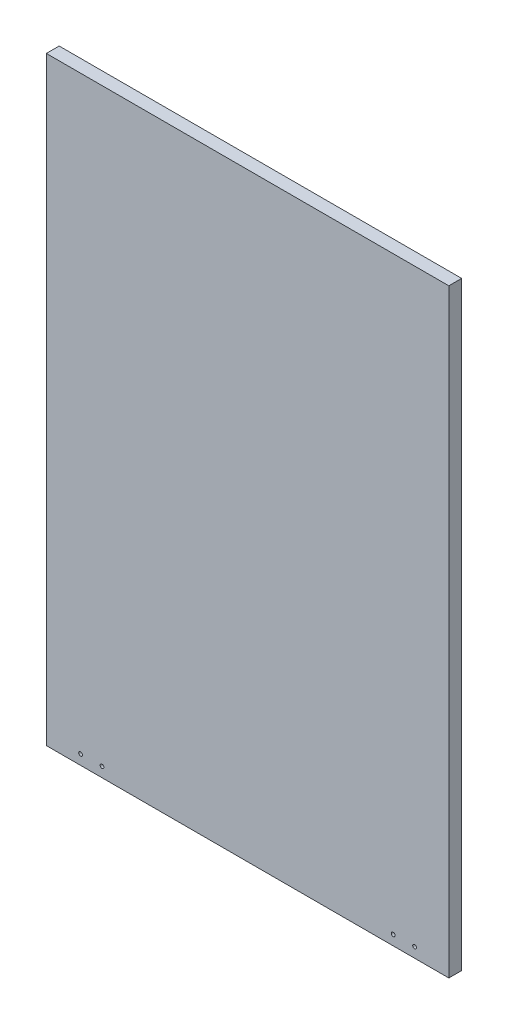
ISO-10303-21;
HEADER;
FILE_DESCRIPTION(('STEP AP214'),'2;1');
FILE_NAME('part.step','',(''),(''),'','','');
FILE_SCHEMA(('AUTOMOTIVE_DESIGN { 1 0 10303 214 1 1 1 1 }'));
ENDSEC;
DATA;
#1=APPLICATION_CONTEXT('core data for automotive mechanical design processes');
#2=APPLICATION_PROTOCOL_DEFINITION('international standard','automotive_design',2000,#1);
#3=PRODUCT_CONTEXT('',#1,'mechanical');
#4=PRODUCT('Part','Part','',(#3));
#5=PRODUCT_RELATED_PRODUCT_CATEGORY('part','',(#4));
#6=PRODUCT_DEFINITION_FORMATION('','',#4);
#7=PRODUCT_DEFINITION_CONTEXT('part definition',#1,'design');
#8=PRODUCT_DEFINITION('design','',#6,#7);
#9=PRODUCT_DEFINITION_SHAPE('','',#8);
#10=(LENGTH_UNIT() NAMED_UNIT(*) SI_UNIT(.MILLI.,.METRE.));
#11=(NAMED_UNIT(*) PLANE_ANGLE_UNIT() SI_UNIT($,.RADIAN.));
#12=(NAMED_UNIT(*) SI_UNIT($,.STERADIAN.) SOLID_ANGLE_UNIT());
#13=UNCERTAINTY_MEASURE_WITH_UNIT(LENGTH_MEASURE(1.E-05),#10,'distance_accuracy_value','');
#14=(GEOMETRIC_REPRESENTATION_CONTEXT(3) GLOBAL_UNCERTAINTY_ASSIGNED_CONTEXT((#13)) GLOBAL_UNIT_ASSIGNED_CONTEXT((#10,
#11,#12)) REPRESENTATION_CONTEXT('',''));
#15=CARTESIAN_POINT('',(0.,0.,0.));
#16=DIRECTION('',(0.,0.,1.));
#17=DIRECTION('',(1.,0.,0.));
#18=AXIS2_PLACEMENT_3D('',#15,#16,#17);
#19=CARTESIAN_POINT('',(0.,0.,15.));
#20=DIRECTION('',(0.,0.,1.));
#21=DIRECTION('',(1.,0.,0.));
#22=AXIS2_PLACEMENT_3D('',#19,#20,#21);
#23=PLANE('',#22);
#24=CARTESIAN_POINT('',(-170.,-338.4,15.));
#25=DIRECTION('',(0.,0.,1.));
#26=DIRECTION('',(1.,0.,0.));
#27=AXIS2_PLACEMENT_3D('',#24,#25,#26);
#28=CIRCLE('',#27,2.20000000000001);
#29=CARTESIAN_POINT('',(-167.8,-338.4,15.));
#30=VERTEX_POINT('',#29);
#31=EDGE_CURVE('E120',#30,#30,#28,.T.);
#32=ORIENTED_EDGE('',*,*,#31,.F.);
#33=EDGE_LOOP('',(#32));
#34=FACE_BOUND('',#33,.T.);
#35=CARTESIAN_POINT('',(-195.,-338.4,15.));
#36=DIRECTION('',(0.,0.,1.));
#37=DIRECTION('',(1.,0.,0.));
#38=AXIS2_PLACEMENT_3D('',#35,#36,#37);
#39=CIRCLE('',#38,2.20000000000001);
#40=CARTESIAN_POINT('',(-192.8,-338.4,15.));
#41=VERTEX_POINT('',#40);
#42=EDGE_CURVE('E99',#41,#41,#39,.T.);
#43=ORIENTED_EDGE('',*,*,#42,.F.);
#44=EDGE_LOOP('',(#43));
#45=FACE_BOUND('',#44,.T.);
#46=DIRECTION('',(0.,1.,0.));
#47=VECTOR('',#46,1.);
#48=CARTESIAN_POINT('',(235.,350.,15.));
#49=LINE('',#48,#47);
#50=CARTESIAN_POINT('',(235.,-350.,15.));
#51=VERTEX_POINT('',#50);
#52=CARTESIAN_POINT('',(235.,350.,15.));
#53=VERTEX_POINT('',#52);
#54=EDGE_CURVE('E84',#51,#53,#49,.T.);
#55=ORIENTED_EDGE('',*,*,#54,.T.);
#56=DIRECTION('',(-1.,0.,0.));
#57=VECTOR('',#56,1.);
#58=CARTESIAN_POINT('',(-235.,350.,15.));
#59=LINE('',#58,#57);
#60=CARTESIAN_POINT('',(-235.,350.,15.));
#61=VERTEX_POINT('',#60);
#62=EDGE_CURVE('E79',#53,#61,#59,.T.);
#63=ORIENTED_EDGE('',*,*,#62,.T.);
#64=DIRECTION('',(0.,-1.,0.));
#65=VECTOR('',#64,1.);
#66=CARTESIAN_POINT('',(-235.,350.,15.));
#67=LINE('',#66,#65);
#68=CARTESIAN_POINT('',(-235.,-350.,15.));
#69=VERTEX_POINT('',#68);
#70=EDGE_CURVE('E82',#61,#69,#67,.T.);
#71=ORIENTED_EDGE('',*,*,#70,.T.);
#72=DIRECTION('',(1.,0.,0.));
#73=VECTOR('',#72,1.);
#74=CARTESIAN_POINT('',(-235.,-350.,15.));
#75=LINE('',#74,#73);
#76=EDGE_CURVE('E49',#69,#51,#75,.T.);
#77=ORIENTED_EDGE('',*,*,#76,.T.);
#78=EDGE_LOOP('',(#55,#63,#71,#77));
#79=FACE_BOUND('',#78,.T.);
#80=CARTESIAN_POINT('',(195.,-338.4,15.));
#81=DIRECTION('',(0.,0.,1.));
#82=DIRECTION('',(1.,0.,0.));
#83=AXIS2_PLACEMENT_3D('',#80,#81,#82);
#84=CIRCLE('',#83,2.20000000000001);
#85=CARTESIAN_POINT('',(197.2,-338.4,15.));
#86=VERTEX_POINT('',#85);
#87=EDGE_CURVE('E114',#86,#86,#84,.T.);
#88=ORIENTED_EDGE('',*,*,#87,.F.);
#89=EDGE_LOOP('',(#88));
#90=FACE_BOUND('',#89,.T.);
#91=CARTESIAN_POINT('',(170.,-338.4,15.));
#92=DIRECTION('',(0.,0.,1.));
#93=DIRECTION('',(1.,0.,0.));
#94=AXIS2_PLACEMENT_3D('',#91,#92,#93);
#95=CIRCLE('',#94,2.20000000000001);
#96=CARTESIAN_POINT('',(172.2,-338.4,15.));
#97=VERTEX_POINT('',#96);
#98=EDGE_CURVE('E126',#97,#97,#95,.T.);
#99=ORIENTED_EDGE('',*,*,#98,.F.);
#100=EDGE_LOOP('',(#99));
#101=FACE_BOUND('',#100,.T.);
#102=ADVANCED_FACE('F32',(#34,#45,#79,#90,#101),#23,.T.);
#103=CARTESIAN_POINT('',(0.,0.,0.));
#104=DIRECTION('',(0.,0.,1.));
#105=DIRECTION('',(1.,0.,0.));
#106=AXIS2_PLACEMENT_3D('',#103,#104,#105);
#107=PLANE('',#106);
#108=CARTESIAN_POINT('',(-170.,-338.4,0.));
#109=DIRECTION('',(0.,0.,1.));
#110=DIRECTION('',(1.,0.,0.));
#111=AXIS2_PLACEMENT_3D('',#108,#109,#110);
#112=CIRCLE('',#111,2.20000000000001);
#113=CARTESIAN_POINT('',(-167.8,-338.4,0.));
#114=VERTEX_POINT('',#113);
#115=EDGE_CURVE('E123',#114,#114,#112,.T.);
#116=ORIENTED_EDGE('',*,*,#115,.T.);
#117=EDGE_LOOP('',(#116));
#118=FACE_BOUND('',#117,.T.);
#119=CARTESIAN_POINT('',(-195.,-338.4,0.));
#120=DIRECTION('',(0.,0.,1.));
#121=DIRECTION('',(1.,0.,0.));
#122=AXIS2_PLACEMENT_3D('',#119,#120,#121);
#123=CIRCLE('',#122,2.20000000000001);
#124=CARTESIAN_POINT('',(-192.8,-338.4,0.));
#125=VERTEX_POINT('',#124);
#126=EDGE_CURVE('E111',#125,#125,#123,.T.);
#127=ORIENTED_EDGE('',*,*,#126,.T.);
#128=EDGE_LOOP('',(#127));
#129=FACE_BOUND('',#128,.T.);
#130=DIRECTION('',(0.,1.,0.));
#131=VECTOR('',#130,1.);
#132=CARTESIAN_POINT('',(235.,350.,0.));
#133=LINE('',#132,#131);
#134=CARTESIAN_POINT('',(235.,-350.,0.));
#135=VERTEX_POINT('',#134);
#136=CARTESIAN_POINT('',(235.,350.,0.));
#137=VERTEX_POINT('',#136);
#138=EDGE_CURVE('E96',#135,#137,#133,.T.);
#139=ORIENTED_EDGE('',*,*,#138,.F.);
#140=DIRECTION('',(1.,0.,0.));
#141=VECTOR('',#140,1.);
#142=CARTESIAN_POINT('',(-235.,-350.,0.));
#143=LINE('',#142,#141);
#144=CARTESIAN_POINT('',(-235.,-350.,0.));
#145=VERTEX_POINT('',#144);
#146=EDGE_CURVE('E72',#145,#135,#143,.T.);
#147=ORIENTED_EDGE('',*,*,#146,.F.);
#148=DIRECTION('',(0.,-1.,0.));
#149=VECTOR('',#148,1.);
#150=CARTESIAN_POINT('',(-235.,350.,0.));
#151=LINE('',#150,#149);
#152=CARTESIAN_POINT('',(-235.,350.,0.));
#153=VERTEX_POINT('',#152);
#154=EDGE_CURVE('E66',#153,#145,#151,.T.);
#155=ORIENTED_EDGE('',*,*,#154,.F.);
#156=DIRECTION('',(-1.,0.,0.));
#157=VECTOR('',#156,1.);
#158=CARTESIAN_POINT('',(-235.,350.,0.));
#159=LINE('',#158,#157);
#160=EDGE_CURVE('E88',#137,#153,#159,.T.);
#161=ORIENTED_EDGE('',*,*,#160,.F.);
#162=EDGE_LOOP('',(#139,#147,#155,#161));
#163=FACE_BOUND('',#162,.T.);
#164=CARTESIAN_POINT('',(195.,-338.4,0.));
#165=DIRECTION('',(0.,0.,1.));
#166=DIRECTION('',(1.,0.,0.));
#167=AXIS2_PLACEMENT_3D('',#164,#165,#166);
#168=CIRCLE('',#167,2.20000000000001);
#169=CARTESIAN_POINT('',(197.2,-338.4,0.));
#170=VERTEX_POINT('',#169);
#171=EDGE_CURVE('E117',#170,#170,#168,.T.);
#172=ORIENTED_EDGE('',*,*,#171,.T.);
#173=EDGE_LOOP('',(#172));
#174=FACE_BOUND('',#173,.T.);
#175=CARTESIAN_POINT('',(170.,-338.4,0.));
#176=DIRECTION('',(0.,0.,1.));
#177=DIRECTION('',(1.,0.,0.));
#178=AXIS2_PLACEMENT_3D('',#175,#176,#177);
#179=CIRCLE('',#178,2.20000000000001);
#180=CARTESIAN_POINT('',(172.2,-338.4,0.));
#181=VERTEX_POINT('',#180);
#182=EDGE_CURVE('E129',#181,#181,#179,.T.);
#183=ORIENTED_EDGE('',*,*,#182,.T.);
#184=EDGE_LOOP('',(#183));
#185=FACE_BOUND('',#184,.T.);
#186=ADVANCED_FACE('F107',(#118,#129,#163,#174,#185),#107,.F.);
#187=CARTESIAN_POINT('',(235.,350.,15.));
#188=DIRECTION('',(-1.,0.,0.));
#189=DIRECTION('',(0.,-1.,0.));
#190=AXIS2_PLACEMENT_3D('',#187,#188,#189);
#191=PLANE('',#190);
#192=ORIENTED_EDGE('',*,*,#138,.T.);
#193=DIRECTION('',(0.,0.,-1.));
#194=VECTOR('',#193,1.);
#195=CARTESIAN_POINT('',(235.,350.,15.));
#196=LINE('',#195,#194);
#197=EDGE_CURVE('E11',#53,#137,#196,.T.);
#198=ORIENTED_EDGE('',*,*,#197,.F.);
#199=ORIENTED_EDGE('',*,*,#54,.F.);
#200=DIRECTION('',(0.,0.,-1.));
#201=VECTOR('',#200,1.);
#202=CARTESIAN_POINT('',(235.,-350.,15.));
#203=LINE('',#202,#201);
#204=EDGE_CURVE('E92',#51,#135,#203,.T.);
#205=ORIENTED_EDGE('',*,*,#204,.T.);
#206=EDGE_LOOP('',(#192,#198,#199,#205));
#207=FACE_BOUND('',#206,.T.);
#208=ADVANCED_FACE('F34',(#207),#191,.F.);
#209=CARTESIAN_POINT('',(-235.,350.,15.));
#210=DIRECTION('',(0.,-1.,0.));
#211=DIRECTION('',(0.,0.,-1.));
#212=AXIS2_PLACEMENT_3D('',#209,#210,#211);
#213=PLANE('',#212);
#214=ORIENTED_EDGE('',*,*,#160,.T.);
#215=DIRECTION('',(0.,0.,-1.));
#216=VECTOR('',#215,1.);
#217=CARTESIAN_POINT('',(-235.,350.,15.));
#218=LINE('',#217,#216);
#219=EDGE_CURVE('E41',#61,#153,#218,.T.);
#220=ORIENTED_EDGE('',*,*,#219,.F.);
#221=ORIENTED_EDGE('',*,*,#62,.F.);
#222=ORIENTED_EDGE('',*,*,#197,.T.);
#223=EDGE_LOOP('',(#214,#220,#221,#222));
#224=FACE_BOUND('',#223,.T.);
#225=ADVANCED_FACE('F87',(#224),#213,.F.);
#226=CARTESIAN_POINT('',(-235.,350.,15.));
#227=DIRECTION('',(1.,0.,0.));
#228=DIRECTION('',(0.,1.,0.));
#229=AXIS2_PLACEMENT_3D('',#226,#227,#228);
#230=PLANE('',#229);
#231=ORIENTED_EDGE('',*,*,#154,.T.);
#232=DIRECTION('',(0.,0.,-1.));
#233=VECTOR('',#232,1.);
#234=CARTESIAN_POINT('',(-235.,-350.,15.));
#235=LINE('',#234,#233);
#236=EDGE_CURVE('E89',#69,#145,#235,.T.);
#237=ORIENTED_EDGE('',*,*,#236,.F.);
#238=ORIENTED_EDGE('',*,*,#70,.F.);
#239=ORIENTED_EDGE('',*,*,#219,.T.);
#240=EDGE_LOOP('',(#231,#237,#238,#239));
#241=FACE_BOUND('',#240,.T.);
#242=ADVANCED_FACE('F90',(#241),#230,.F.);
#243=CARTESIAN_POINT('',(-235.,-350.,15.));
#244=DIRECTION('',(0.,1.,0.));
#245=DIRECTION('',(0.,0.,1.));
#246=AXIS2_PLACEMENT_3D('',#243,#244,#245);
#247=PLANE('',#246);
#248=ORIENTED_EDGE('',*,*,#146,.T.);
#249=ORIENTED_EDGE('',*,*,#204,.F.);
#250=ORIENTED_EDGE('',*,*,#76,.F.);
#251=ORIENTED_EDGE('',*,*,#236,.T.);
#252=EDGE_LOOP('',(#248,#249,#250,#251));
#253=FACE_BOUND('',#252,.T.);
#254=ADVANCED_FACE('F104',(#253),#247,.F.);
#255=CARTESIAN_POINT('',(-195.,-338.4,15.));
#256=DIRECTION('',(0.,0.,-1.));
#257=DIRECTION('',(-1.,0.,0.));
#258=AXIS2_PLACEMENT_3D('',#255,#256,#257);
#259=CYLINDRICAL_SURFACE('',#258,2.20000000000001);
#260=ORIENTED_EDGE('',*,*,#42,.T.);
#261=EDGE_LOOP('',(#260));
#262=FACE_BOUND('',#261,.T.);
#263=ORIENTED_EDGE('',*,*,#126,.F.);
#264=EDGE_LOOP('',(#263));
#265=FACE_BOUND('',#264,.T.);
#266=ADVANCED_FACE('F149',(#262,#265),#259,.F.);
#267=CARTESIAN_POINT('',(195.,-338.4,15.));
#268=DIRECTION('',(0.,0.,-1.));
#269=DIRECTION('',(-1.,0.,0.));
#270=AXIS2_PLACEMENT_3D('',#267,#268,#269);
#271=CYLINDRICAL_SURFACE('',#270,2.20000000000001);
#272=ORIENTED_EDGE('',*,*,#87,.T.);
#273=EDGE_LOOP('',(#272));
#274=FACE_BOUND('',#273,.T.);
#275=ORIENTED_EDGE('',*,*,#171,.F.);
#276=EDGE_LOOP('',(#275));
#277=FACE_BOUND('',#276,.T.);
#278=ADVANCED_FACE('F195',(#274,#277),#271,.F.);
#279=CARTESIAN_POINT('',(-170.,-338.4,15.));
#280=DIRECTION('',(0.,0.,-1.));
#281=DIRECTION('',(-1.,0.,0.));
#282=AXIS2_PLACEMENT_3D('',#279,#280,#281);
#283=CYLINDRICAL_SURFACE('',#282,2.20000000000001);
#284=ORIENTED_EDGE('',*,*,#31,.T.);
#285=EDGE_LOOP('',(#284));
#286=FACE_BOUND('',#285,.T.);
#287=ORIENTED_EDGE('',*,*,#115,.F.);
#288=EDGE_LOOP('',(#287));
#289=FACE_BOUND('',#288,.T.);
#290=ADVANCED_FACE('F203',(#286,#289),#283,.F.);
#291=CARTESIAN_POINT('',(170.,-338.4,15.));
#292=DIRECTION('',(0.,0.,-1.));
#293=DIRECTION('',(-1.,0.,0.));
#294=AXIS2_PLACEMENT_3D('',#291,#292,#293);
#295=CYLINDRICAL_SURFACE('',#294,2.20000000000001);
#296=ORIENTED_EDGE('',*,*,#98,.T.);
#297=EDGE_LOOP('',(#296));
#298=FACE_BOUND('',#297,.T.);
#299=ORIENTED_EDGE('',*,*,#182,.F.);
#300=EDGE_LOOP('',(#299));
#301=FACE_BOUND('',#300,.T.);
#302=ADVANCED_FACE('F135',(#298,#301),#295,.F.);
#303=CLOSED_SHELL('',(#102,#186,#208,#225,#242,#254,#266,#278,#290,#302));
#304=MANIFOLD_SOLID_BREP('B2',#303);
#305=ADVANCED_BREP_SHAPE_REPRESENTATION('',(#18,#304),#14);
#306=SHAPE_DEFINITION_REPRESENTATION(#9,#305);
ENDSEC;
END-ISO-10303-21;
